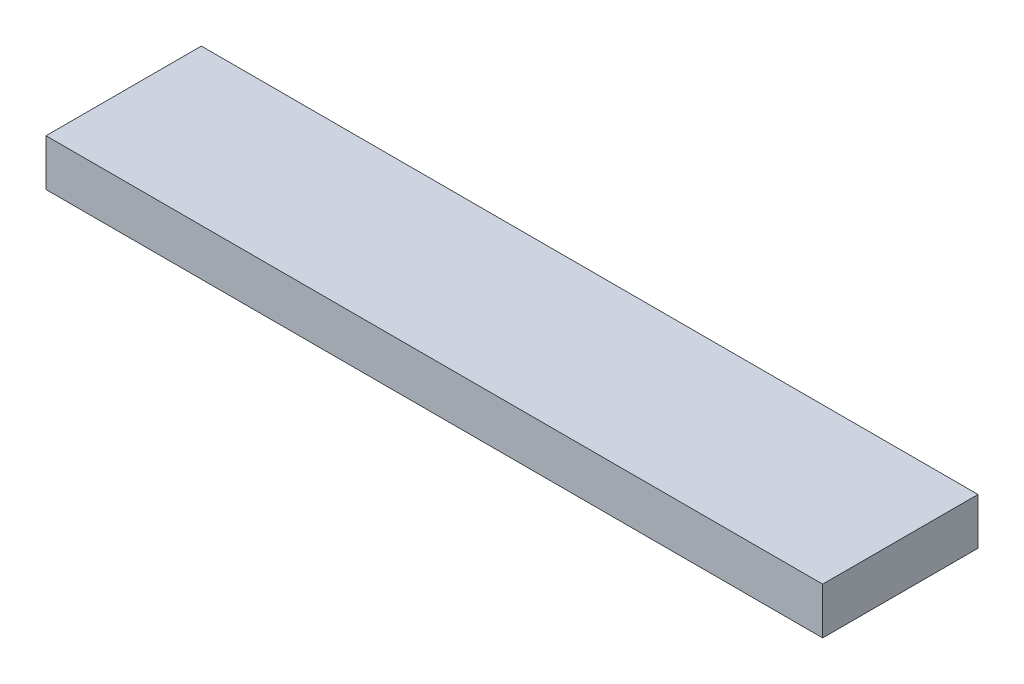
ISO-10303-21;
HEADER;
FILE_DESCRIPTION(('STEP AP214'),'2;1');
FILE_NAME('part.step','',(''),(''),'','','');
FILE_SCHEMA(('AUTOMOTIVE_DESIGN { 1 0 10303 214 1 1 1 1 }'));
ENDSEC;
DATA;
#1=APPLICATION_CONTEXT('core data for automotive mechanical design processes');
#2=APPLICATION_PROTOCOL_DEFINITION('international standard','automotive_design',2000,#1);
#3=PRODUCT_CONTEXT('',#1,'mechanical');
#4=PRODUCT('Part','Part','',(#3));
#5=PRODUCT_RELATED_PRODUCT_CATEGORY('part','',(#4));
#6=PRODUCT_DEFINITION_FORMATION('','',#4);
#7=PRODUCT_DEFINITION_CONTEXT('part definition',#1,'design');
#8=PRODUCT_DEFINITION('design','',#6,#7);
#9=PRODUCT_DEFINITION_SHAPE('','',#8);
#10=(LENGTH_UNIT() NAMED_UNIT(*) SI_UNIT(.MILLI.,.METRE.));
#11=(NAMED_UNIT(*) PLANE_ANGLE_UNIT() SI_UNIT($,.RADIAN.));
#12=(NAMED_UNIT(*) SI_UNIT($,.STERADIAN.) SOLID_ANGLE_UNIT());
#13=UNCERTAINTY_MEASURE_WITH_UNIT(LENGTH_MEASURE(1.E-05),#10,'distance_accuracy_value','');
#14=(GEOMETRIC_REPRESENTATION_CONTEXT(3) GLOBAL_UNCERTAINTY_ASSIGNED_CONTEXT((#13)) GLOBAL_UNIT_ASSIGNED_CONTEXT((#10,
#11,#12)) REPRESENTATION_CONTEXT('',''));
#15=CARTESIAN_POINT('',(0.,0.,0.));
#16=DIRECTION('',(0.,0.,1.));
#17=DIRECTION('',(1.,0.,0.));
#18=AXIS2_PLACEMENT_3D('',#15,#16,#17);
#19=CARTESIAN_POINT('',(-64.1921397379913,6.,-23.5080058224163));
#20=DIRECTION('',(1.,0.,0.));
#21=DIRECTION('',(0.,0.,-1.));
#22=AXIS2_PLACEMENT_3D('',#19,#20,#21);
#23=PLANE('',#22);
#24=DIRECTION('',(0.,0.,1.));
#25=VECTOR('',#24,1.);
#26=CARTESIAN_POINT('',(-64.1921397379913,0.,-23.5080058224163));
#27=LINE('',#26,#25);
#28=CARTESIAN_POINT('',(-64.1921397379913,0.,-23.5080058224163));
#29=VERTEX_POINT('',#28);
#30=CARTESIAN_POINT('',(-64.1921397379913,0.,-3.50800582241631));
#31=VERTEX_POINT('',#30);
#32=EDGE_CURVE('E107',#29,#31,#27,.T.);
#33=ORIENTED_EDGE('',*,*,#32,.T.);
#34=DIRECTION('',(0.,-1.,0.));
#35=VECTOR('',#34,1.);
#36=CARTESIAN_POINT('',(-64.1921397379913,6.,-3.50800582241631));
#37=LINE('',#36,#35);
#38=CARTESIAN_POINT('',(-64.1921397379913,6.,-3.50800582241631));
#39=VERTEX_POINT('',#38);
#40=EDGE_CURVE('E11',#39,#31,#37,.T.);
#41=ORIENTED_EDGE('',*,*,#40,.F.);
#42=DIRECTION('',(0.,0.,1.));
#43=VECTOR('',#42,1.);
#44=CARTESIAN_POINT('',(-64.1921397379913,6.,-23.5080058224163));
#45=LINE('',#44,#43);
#46=CARTESIAN_POINT('',(-64.1921397379913,6.,-23.5080058224163));
#47=VERTEX_POINT('',#46);
#48=EDGE_CURVE('E89',#47,#39,#45,.T.);
#49=ORIENTED_EDGE('',*,*,#48,.F.);
#50=DIRECTION('',(0.,-1.,0.));
#51=VECTOR('',#50,1.);
#52=CARTESIAN_POINT('',(-64.1921397379913,6.,-23.5080058224163));
#53=LINE('',#52,#51);
#54=EDGE_CURVE('E56',#47,#29,#53,.T.);
#55=ORIENTED_EDGE('',*,*,#54,.T.);
#56=EDGE_LOOP('',(#33,#41,#49,#55));
#57=FACE_BOUND('',#56,.T.);
#58=ADVANCED_FACE('F39',(#57),#23,.F.);
#59=CARTESIAN_POINT('',(-64.1921397379913,6.,-3.50800582241631));
#60=DIRECTION('',(0.,0.,-1.));
#61=DIRECTION('',(-1.,0.,0.));
#62=AXIS2_PLACEMENT_3D('',#59,#60,#61);
#63=PLANE('',#62);
#64=DIRECTION('',(1.,0.,0.));
#65=VECTOR('',#64,1.);
#66=CARTESIAN_POINT('',(-64.1921397379913,0.,-3.50800582241631));
#67=LINE('',#66,#65);
#68=CARTESIAN_POINT('',(35.8078602620087,0.,-3.50800582241631));
#69=VERTEX_POINT('',#68);
#70=EDGE_CURVE('E95',#31,#69,#67,.T.);
#71=ORIENTED_EDGE('',*,*,#70,.T.);
#72=DIRECTION('',(0.,-1.,0.));
#73=VECTOR('',#72,1.);
#74=CARTESIAN_POINT('',(35.8078602620087,6.,-3.50800582241631));
#75=LINE('',#74,#73);
#76=CARTESIAN_POINT('',(35.8078602620087,6.,-3.50800582241631));
#77=VERTEX_POINT('',#76);
#78=EDGE_CURVE('E48',#77,#69,#75,.T.);
#79=ORIENTED_EDGE('',*,*,#78,.F.);
#80=DIRECTION('',(1.,0.,0.));
#81=VECTOR('',#80,1.);
#82=CARTESIAN_POINT('',(-64.1921397379913,6.,-3.50800582241631));
#83=LINE('',#82,#81);
#84=EDGE_CURVE('E81',#39,#77,#83,.T.);
#85=ORIENTED_EDGE('',*,*,#84,.F.);
#86=ORIENTED_EDGE('',*,*,#40,.T.);
#87=EDGE_LOOP('',(#71,#79,#85,#86));
#88=FACE_BOUND('',#87,.T.);
#89=ADVANCED_FACE('F94',(#88),#63,.F.);
#90=CARTESIAN_POINT('',(35.8078602620087,6.,-23.5080058224163));
#91=DIRECTION('',(1.,0.,0.));
#92=DIRECTION('',(0.,0.,-1.));
#93=AXIS2_PLACEMENT_3D('',#90,#91,#92);
#94=PLANE('',#93);
#95=DIRECTION('',(0.,0.,1.));
#96=VECTOR('',#95,1.);
#97=CARTESIAN_POINT('',(35.8078602620087,0.,-23.5080058224163));
#98=LINE('',#97,#96);
#99=CARTESIAN_POINT('',(35.8078602620087,0.,-23.5080058224163));
#100=VERTEX_POINT('',#99);
#101=EDGE_CURVE('E112',#100,#69,#98,.T.);
#102=ORIENTED_EDGE('',*,*,#101,.F.);
#103=DIRECTION('',(0.,-1.,0.));
#104=VECTOR('',#103,1.);
#105=CARTESIAN_POINT('',(35.8078602620087,6.,-23.5080058224163));
#106=LINE('',#105,#104);
#107=CARTESIAN_POINT('',(35.8078602620087,6.,-23.5080058224163));
#108=VERTEX_POINT('',#107);
#109=EDGE_CURVE('E70',#108,#100,#106,.T.);
#110=ORIENTED_EDGE('',*,*,#109,.F.);
#111=DIRECTION('',(0.,0.,1.));
#112=VECTOR('',#111,1.);
#113=CARTESIAN_POINT('',(35.8078602620087,6.,-23.5080058224163));
#114=LINE('',#113,#112);
#115=EDGE_CURVE('E88',#108,#77,#114,.T.);
#116=ORIENTED_EDGE('',*,*,#115,.T.);
#117=ORIENTED_EDGE('',*,*,#78,.T.);
#118=EDGE_LOOP('',(#102,#110,#116,#117));
#119=FACE_BOUND('',#118,.T.);
#120=ADVANCED_FACE('F99',(#119),#94,.T.);
#121=CARTESIAN_POINT('',(-64.1921397379913,6.,-23.5080058224163));
#122=DIRECTION('',(0.,0.,-1.));
#123=DIRECTION('',(-1.,0.,0.));
#124=AXIS2_PLACEMENT_3D('',#121,#122,#123);
#125=PLANE('',#124);
#126=DIRECTION('',(1.,0.,0.));
#127=VECTOR('',#126,1.);
#128=CARTESIAN_POINT('',(-64.1921397379913,0.,-23.5080058224163));
#129=LINE('',#128,#127);
#130=EDGE_CURVE('E115',#29,#100,#129,.T.);
#131=ORIENTED_EDGE('',*,*,#130,.F.);
#132=ORIENTED_EDGE('',*,*,#54,.F.);
#133=DIRECTION('',(1.,0.,0.));
#134=VECTOR('',#133,1.);
#135=CARTESIAN_POINT('',(-64.1921397379913,6.,-23.5080058224163));
#136=LINE('',#135,#134);
#137=EDGE_CURVE('E101',#47,#108,#136,.T.);
#138=ORIENTED_EDGE('',*,*,#137,.T.);
#139=ORIENTED_EDGE('',*,*,#109,.T.);
#140=EDGE_LOOP('',(#131,#132,#138,#139));
#141=FACE_BOUND('',#140,.T.);
#142=ADVANCED_FACE('F125',(#141),#125,.T.);
#143=CARTESIAN_POINT('',(0.,6.,0.));
#144=DIRECTION('',(0.,1.,0.));
#145=DIRECTION('',(0.,0.,1.));
#146=AXIS2_PLACEMENT_3D('',#143,#144,#145);
#147=PLANE('',#146);
#148=ORIENTED_EDGE('',*,*,#48,.T.);
#149=ORIENTED_EDGE('',*,*,#84,.T.);
#150=ORIENTED_EDGE('',*,*,#115,.F.);
#151=ORIENTED_EDGE('',*,*,#137,.F.);
#152=EDGE_LOOP('',(#148,#149,#150,#151));
#153=FACE_BOUND('',#152,.T.);
#154=ADVANCED_FACE('F85',(#153),#147,.T.);
#155=CARTESIAN_POINT('',(0.,0.,0.));
#156=DIRECTION('',(0.,1.,0.));
#157=DIRECTION('',(0.,0.,1.));
#158=AXIS2_PLACEMENT_3D('',#155,#156,#157);
#159=PLANE('',#158);
#160=ORIENTED_EDGE('',*,*,#32,.F.);
#161=ORIENTED_EDGE('',*,*,#130,.T.);
#162=ORIENTED_EDGE('',*,*,#101,.T.);
#163=ORIENTED_EDGE('',*,*,#70,.F.);
#164=EDGE_LOOP('',(#160,#161,#162,#163));
#165=FACE_BOUND('',#164,.T.);
#166=ADVANCED_FACE('F124',(#165),#159,.F.);
#167=CLOSED_SHELL('',(#58,#89,#120,#142,#154,#166));
#168=MANIFOLD_SOLID_BREP('B2',#167);
#169=ADVANCED_BREP_SHAPE_REPRESENTATION('',(#18,#168),#14);
#170=SHAPE_DEFINITION_REPRESENTATION(#9,#169);
ENDSEC;
END-ISO-10303-21;
